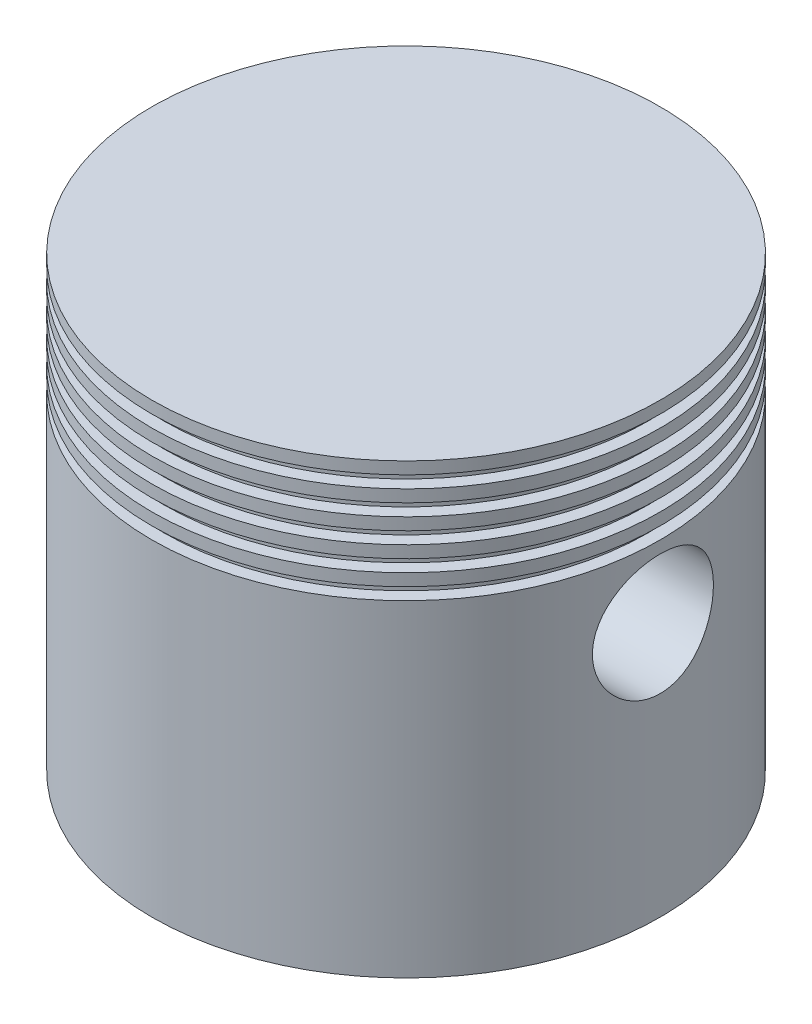
ISO-10303-21;
HEADER;
FILE_DESCRIPTION(('STEP AP214'),'2;1');
FILE_NAME('part.step','',(''),(''),'','','');
FILE_SCHEMA(('AUTOMOTIVE_DESIGN { 1 0 10303 214 1 1 1 1 }'));
ENDSEC;
DATA;
#1=APPLICATION_CONTEXT('core data for automotive mechanical design processes');
#2=APPLICATION_PROTOCOL_DEFINITION('international standard','automotive_design',2000,#1);
#3=PRODUCT_CONTEXT('',#1,'mechanical');
#4=PRODUCT('Part','Part','',(#3));
#5=PRODUCT_RELATED_PRODUCT_CATEGORY('part','',(#4));
#6=PRODUCT_DEFINITION_FORMATION('','',#4);
#7=PRODUCT_DEFINITION_CONTEXT('part definition',#1,'design');
#8=PRODUCT_DEFINITION('design','',#6,#7);
#9=PRODUCT_DEFINITION_SHAPE('','',#8);
#10=(LENGTH_UNIT() NAMED_UNIT(*) SI_UNIT(.MILLI.,.METRE.));
#11=(NAMED_UNIT(*) PLANE_ANGLE_UNIT() SI_UNIT($,.RADIAN.));
#12=(NAMED_UNIT(*) SI_UNIT($,.STERADIAN.) SOLID_ANGLE_UNIT());
#13=UNCERTAINTY_MEASURE_WITH_UNIT(LENGTH_MEASURE(1.E-05),#10,'distance_accuracy_value','');
#14=(GEOMETRIC_REPRESENTATION_CONTEXT(3) GLOBAL_UNCERTAINTY_ASSIGNED_CONTEXT((#13)) GLOBAL_UNIT_ASSIGNED_CONTEXT((#10,
#11,#12)) REPRESENTATION_CONTEXT('',''));
#15=CARTESIAN_POINT('',(0.,0.,0.));
#16=DIRECTION('',(0.,0.,1.));
#17=DIRECTION('',(1.,0.,0.));
#18=AXIS2_PLACEMENT_3D('',#15,#16,#17);
#19=CARTESIAN_POINT('',(0.,-18.5,0.));
#20=DIRECTION('',(0.,1.,0.));
#21=DIRECTION('',(0.,0.,1.));
#22=AXIS2_PLACEMENT_3D('',#19,#20,#21);
#23=CYLINDRICAL_SURFACE('',#22,10.5);
#24=CARTESIAN_POINT('',(0.,-4.,0.));
#25=DIRECTION('',(0.,1.,0.));
#26=DIRECTION('',(0.,0.,1.));
#27=AXIS2_PLACEMENT_3D('',#24,#25,#26);
#28=CIRCLE('',#27,10.5);
#29=CARTESIAN_POINT('',(0.,-4.,10.5));
#30=VERTEX_POINT('',#29);
#31=EDGE_CURVE('E219',#30,#30,#28,.T.);
#32=ORIENTED_EDGE('',*,*,#31,.F.);
#33=EDGE_LOOP('',(#32));
#34=FACE_BOUND('',#33,.T.);
#35=CARTESIAN_POINT('',(0.,-4.5,0.));
#36=DIRECTION('',(0.,1.,0.));
#37=DIRECTION('',(0.,0.,1.));
#38=AXIS2_PLACEMENT_3D('',#35,#36,#37);
#39=CIRCLE('',#38,10.5);
#40=CARTESIAN_POINT('',(0.,-4.5,10.5));
#41=VERTEX_POINT('',#40);
#42=EDGE_CURVE('E216',#41,#41,#39,.T.);
#43=ORIENTED_EDGE('',*,*,#42,.T.);
#44=EDGE_LOOP('',(#43));
#45=FACE_BOUND('',#44,.T.);
#46=ADVANCED_FACE('F33',(#34,#45),#23,.T.);
#47=CARTESIAN_POINT('',(0.,-3.,0.));
#48=DIRECTION('',(0.,1.,0.));
#49=DIRECTION('',(0.,0.,1.));
#50=AXIS2_PLACEMENT_3D('',#47,#48,#49);
#51=CIRCLE('',#50,10.5);
#52=CARTESIAN_POINT('',(0.,-3.,10.5));
#53=VERTEX_POINT('',#52);
#54=EDGE_CURVE('E231',#53,#53,#51,.T.);
#55=ORIENTED_EDGE('',*,*,#54,.F.);
#56=EDGE_LOOP('',(#55));
#57=FACE_BOUND('',#56,.T.);
#58=CARTESIAN_POINT('',(0.,-3.5,0.));
#59=DIRECTION('',(0.,1.,0.));
#60=DIRECTION('',(0.,0.,1.));
#61=AXIS2_PLACEMENT_3D('',#58,#59,#60);
#62=CIRCLE('',#61,10.5);
#63=CARTESIAN_POINT('',(0.,-3.5,10.5));
#64=VERTEX_POINT('',#63);
#65=EDGE_CURVE('E228',#64,#64,#62,.T.);
#66=ORIENTED_EDGE('',*,*,#65,.T.);
#67=EDGE_LOOP('',(#66));
#68=FACE_BOUND('',#67,.T.);
#69=ADVANCED_FACE('F184',(#57,#68),#23,.T.);
#70=CARTESIAN_POINT('',(0.,-2.,0.));
#71=DIRECTION('',(0.,1.,0.));
#72=DIRECTION('',(0.,0.,1.));
#73=AXIS2_PLACEMENT_3D('',#70,#71,#72);
#74=CIRCLE('',#73,10.5);
#75=CARTESIAN_POINT('',(0.,-2.,10.5));
#76=VERTEX_POINT('',#75);
#77=EDGE_CURVE('E243',#76,#76,#74,.T.);
#78=ORIENTED_EDGE('',*,*,#77,.F.);
#79=EDGE_LOOP('',(#78));
#80=FACE_BOUND('',#79,.T.);
#81=CARTESIAN_POINT('',(0.,-2.5,0.));
#82=DIRECTION('',(0.,1.,0.));
#83=DIRECTION('',(0.,0.,1.));
#84=AXIS2_PLACEMENT_3D('',#81,#82,#83);
#85=CIRCLE('',#84,10.5);
#86=CARTESIAN_POINT('',(0.,-2.5,10.5));
#87=VERTEX_POINT('',#86);
#88=EDGE_CURVE('E240',#87,#87,#85,.T.);
#89=ORIENTED_EDGE('',*,*,#88,.T.);
#90=EDGE_LOOP('',(#89));
#91=FACE_BOUND('',#90,.T.);
#92=ADVANCED_FACE('F189',(#80,#91),#23,.T.);
#93=CARTESIAN_POINT('',(0.,-1.,0.));
#94=DIRECTION('',(0.,1.,0.));
#95=DIRECTION('',(0.,0.,1.));
#96=AXIS2_PLACEMENT_3D('',#93,#94,#95);
#97=CIRCLE('',#96,10.5);
#98=CARTESIAN_POINT('',(0.,-1.,10.5));
#99=VERTEX_POINT('',#98);
#100=EDGE_CURVE('E255',#99,#99,#97,.T.);
#101=ORIENTED_EDGE('',*,*,#100,.F.);
#102=EDGE_LOOP('',(#101));
#103=FACE_BOUND('',#102,.T.);
#104=CARTESIAN_POINT('',(0.,-1.5,0.));
#105=DIRECTION('',(0.,1.,0.));
#106=DIRECTION('',(0.,0.,1.));
#107=AXIS2_PLACEMENT_3D('',#104,#105,#106);
#108=CIRCLE('',#107,10.5);
#109=CARTESIAN_POINT('',(0.,-1.5,10.5));
#110=VERTEX_POINT('',#109);
#111=EDGE_CURVE('E252',#110,#110,#108,.T.);
#112=ORIENTED_EDGE('',*,*,#111,.T.);
#113=EDGE_LOOP('',(#112));
#114=FACE_BOUND('',#113,.T.);
#115=ADVANCED_FACE('F123',(#103,#114),#23,.T.);
#116=CARTESIAN_POINT('',(0.,-0.5,-10.5));
#117=DIRECTION('',(0.,-1.,0.));
#118=DIRECTION('',(0.,0.,-1.));
#119=AXIS2_PLACEMENT_3D('',#116,#117,#118);
#120=PLANE('',#119);
#121=CARTESIAN_POINT('',(0.,-0.5,0.));
#122=DIRECTION('',(0.,1.,0.));
#123=DIRECTION('',(0.,0.,1.));
#124=AXIS2_PLACEMENT_3D('',#121,#122,#123);
#125=CIRCLE('',#124,10.);
#126=CARTESIAN_POINT('',(0.,-0.5,9.99999999999999));
#127=VERTEX_POINT('',#126);
#128=EDGE_CURVE('E128',#127,#127,#125,.T.);
#129=ORIENTED_EDGE('',*,*,#128,.T.);
#130=EDGE_LOOP('',(#129));
#131=FACE_BOUND('',#130,.T.);
#132=CARTESIAN_POINT('',(0.,-0.5,0.));
#133=DIRECTION('',(0.,1.,0.));
#134=DIRECTION('',(0.,0.,1.));
#135=AXIS2_PLACEMENT_3D('',#132,#133,#134);
#136=CIRCLE('',#135,10.5);
#137=CARTESIAN_POINT('',(0.,-0.5,10.5));
#138=VERTEX_POINT('',#137);
#139=EDGE_CURVE('E126',#138,#138,#136,.T.);
#140=ORIENTED_EDGE('',*,*,#139,.F.);
#141=EDGE_LOOP('',(#140));
#142=FACE_BOUND('',#141,.T.);
#143=ADVANCED_FACE('F154',(#131,#142),#120,.T.);
#144=CARTESIAN_POINT('',(0.,0.,0.));
#145=DIRECTION('',(0.,1.,0.));
#146=DIRECTION('',(0.,0.,1.));
#147=AXIS2_PLACEMENT_3D('',#144,#145,#146);
#148=CYLINDRICAL_SURFACE('',#147,10.);
#149=CARTESIAN_POINT('',(0.,-1.,0.));
#150=DIRECTION('',(0.,1.,0.));
#151=DIRECTION('',(0.,0.,1.));
#152=AXIS2_PLACEMENT_3D('',#149,#150,#151);
#153=CIRCLE('',#152,10.);
#154=CARTESIAN_POINT('',(0.,-1.,9.99999999999999));
#155=VERTEX_POINT('',#154);
#156=EDGE_CURVE('E133',#155,#155,#153,.T.);
#157=ORIENTED_EDGE('',*,*,#156,.T.);
#158=EDGE_LOOP('',(#157));
#159=FACE_BOUND('',#158,.T.);
#160=ORIENTED_EDGE('',*,*,#128,.F.);
#161=EDGE_LOOP('',(#160));
#162=FACE_BOUND('',#161,.T.);
#163=ADVANCED_FACE('F180',(#159,#162),#148,.T.);
#164=CARTESIAN_POINT('',(0.,-1.,-10.));
#165=DIRECTION('',(0.,1.,0.));
#166=DIRECTION('',(0.,0.,1.));
#167=AXIS2_PLACEMENT_3D('',#164,#165,#166);
#168=PLANE('',#167);
#169=ORIENTED_EDGE('',*,*,#100,.T.);
#170=EDGE_LOOP('',(#169));
#171=FACE_BOUND('',#170,.T.);
#172=ORIENTED_EDGE('',*,*,#156,.F.);
#173=EDGE_LOOP('',(#172));
#174=FACE_BOUND('',#173,.T.);
#175=ADVANCED_FACE('F176',(#171,#174),#168,.T.);
#176=CARTESIAN_POINT('',(0.,0.,0.));
#177=DIRECTION('',(0.,1.,0.));
#178=DIRECTION('',(0.,0.,1.));
#179=AXIS2_PLACEMENT_3D('',#176,#177,#178);
#180=PLANE('',#179);
#181=CARTESIAN_POINT('',(0.,0.,0.));
#182=DIRECTION('',(0.,1.,0.));
#183=DIRECTION('',(0.,0.,1.));
#184=AXIS2_PLACEMENT_3D('',#181,#182,#183);
#185=CIRCLE('',#184,10.5);
#186=CARTESIAN_POINT('',(0.,0.,10.5));
#187=VERTEX_POINT('',#186);
#188=EDGE_CURVE('E43',#187,#187,#185,.T.);
#189=ORIENTED_EDGE('',*,*,#188,.T.);
#190=EDGE_LOOP('',(#189));
#191=FACE_BOUND('',#190,.T.);
#192=ADVANCED_FACE('F118',(#191),#180,.T.);
#193=ORIENTED_EDGE('',*,*,#188,.F.);
#194=EDGE_LOOP('',(#193));
#195=FACE_BOUND('',#194,.T.);
#196=ORIENTED_EDGE('',*,*,#139,.T.);
#197=EDGE_LOOP('',(#196));
#198=FACE_BOUND('',#197,.T.);
#199=ADVANCED_FACE('F35',(#195,#198),#23,.T.);
#200=CARTESIAN_POINT('',(0.,-1.5,-10.5));
#201=DIRECTION('',(0.,-1.,0.));
#202=DIRECTION('',(0.,0.,-1.));
#203=AXIS2_PLACEMENT_3D('',#200,#201,#202);
#204=PLANE('',#203);
#205=CARTESIAN_POINT('',(0.,-1.5,0.));
#206=DIRECTION('',(0.,1.,0.));
#207=DIRECTION('',(0.,0.,1.));
#208=AXIS2_PLACEMENT_3D('',#205,#206,#207);
#209=CIRCLE('',#208,10.);
#210=CARTESIAN_POINT('',(0.,-1.5,9.99999999999999));
#211=VERTEX_POINT('',#210);
#212=EDGE_CURVE('E249',#211,#211,#209,.T.);
#213=ORIENTED_EDGE('',*,*,#212,.T.);
#214=EDGE_LOOP('',(#213));
#215=FACE_BOUND('',#214,.T.);
#216=ORIENTED_EDGE('',*,*,#111,.F.);
#217=EDGE_LOOP('',(#216));
#218=FACE_BOUND('',#217,.T.);
#219=ADVANCED_FACE('F122',(#215,#218),#204,.T.);
#220=CARTESIAN_POINT('',(0.,-1.,0.));
#221=DIRECTION('',(0.,1.,0.));
#222=DIRECTION('',(0.,0.,1.));
#223=AXIS2_PLACEMENT_3D('',#220,#221,#222);
#224=CYLINDRICAL_SURFACE('',#223,10.);
#225=CARTESIAN_POINT('',(0.,-2.,0.));
#226=DIRECTION('',(0.,1.,0.));
#227=DIRECTION('',(0.,0.,1.));
#228=AXIS2_PLACEMENT_3D('',#225,#226,#227);
#229=CIRCLE('',#228,10.);
#230=CARTESIAN_POINT('',(0.,-2.,9.99999999999999));
#231=VERTEX_POINT('',#230);
#232=EDGE_CURVE('E246',#231,#231,#229,.T.);
#233=ORIENTED_EDGE('',*,*,#232,.T.);
#234=EDGE_LOOP('',(#233));
#235=FACE_BOUND('',#234,.T.);
#236=ORIENTED_EDGE('',*,*,#212,.F.);
#237=EDGE_LOOP('',(#236));
#238=FACE_BOUND('',#237,.T.);
#239=ADVANCED_FACE('F279',(#235,#238),#224,.T.);
#240=CARTESIAN_POINT('',(0.,-2.,-10.));
#241=DIRECTION('',(0.,1.,0.));
#242=DIRECTION('',(0.,0.,1.));
#243=AXIS2_PLACEMENT_3D('',#240,#241,#242);
#244=PLANE('',#243);
#245=ORIENTED_EDGE('',*,*,#77,.T.);
#246=EDGE_LOOP('',(#245));
#247=FACE_BOUND('',#246,.T.);
#248=ORIENTED_EDGE('',*,*,#232,.F.);
#249=EDGE_LOOP('',(#248));
#250=FACE_BOUND('',#249,.T.);
#251=ADVANCED_FACE('F285',(#247,#250),#244,.T.);
#252=CARTESIAN_POINT('',(0.,-2.5,-10.5));
#253=DIRECTION('',(0.,-1.,0.));
#254=DIRECTION('',(0.,0.,-1.));
#255=AXIS2_PLACEMENT_3D('',#252,#253,#254);
#256=PLANE('',#255);
#257=CARTESIAN_POINT('',(0.,-2.5,0.));
#258=DIRECTION('',(0.,1.,0.));
#259=DIRECTION('',(0.,0.,1.));
#260=AXIS2_PLACEMENT_3D('',#257,#258,#259);
#261=CIRCLE('',#260,10.);
#262=CARTESIAN_POINT('',(0.,-2.5,9.99999999999999));
#263=VERTEX_POINT('',#262);
#264=EDGE_CURVE('E237',#263,#263,#261,.T.);
#265=ORIENTED_EDGE('',*,*,#264,.T.);
#266=EDGE_LOOP('',(#265));
#267=FACE_BOUND('',#266,.T.);
#268=ORIENTED_EDGE('',*,*,#88,.F.);
#269=EDGE_LOOP('',(#268));
#270=FACE_BOUND('',#269,.T.);
#271=ADVANCED_FACE('F291',(#267,#270),#256,.T.);
#272=CARTESIAN_POINT('',(0.,-2.,0.));
#273=DIRECTION('',(0.,1.,0.));
#274=DIRECTION('',(0.,0.,1.));
#275=AXIS2_PLACEMENT_3D('',#272,#273,#274);
#276=CYLINDRICAL_SURFACE('',#275,10.);
#277=CARTESIAN_POINT('',(0.,-3.,0.));
#278=DIRECTION('',(0.,1.,0.));
#279=DIRECTION('',(0.,0.,1.));
#280=AXIS2_PLACEMENT_3D('',#277,#278,#279);
#281=CIRCLE('',#280,10.);
#282=CARTESIAN_POINT('',(0.,-3.,9.99999999999999));
#283=VERTEX_POINT('',#282);
#284=EDGE_CURVE('E234',#283,#283,#281,.T.);
#285=ORIENTED_EDGE('',*,*,#284,.T.);
#286=EDGE_LOOP('',(#285));
#287=FACE_BOUND('',#286,.T.);
#288=ORIENTED_EDGE('',*,*,#264,.F.);
#289=EDGE_LOOP('',(#288));
#290=FACE_BOUND('',#289,.T.);
#291=ADVANCED_FACE('F295',(#287,#290),#276,.T.);
#292=CARTESIAN_POINT('',(0.,-3.,-10.));
#293=DIRECTION('',(0.,1.,0.));
#294=DIRECTION('',(0.,0.,1.));
#295=AXIS2_PLACEMENT_3D('',#292,#293,#294);
#296=PLANE('',#295);
#297=ORIENTED_EDGE('',*,*,#54,.T.);
#298=EDGE_LOOP('',(#297));
#299=FACE_BOUND('',#298,.T.);
#300=ORIENTED_EDGE('',*,*,#284,.F.);
#301=EDGE_LOOP('',(#300));
#302=FACE_BOUND('',#301,.T.);
#303=ADVANCED_FACE('F299',(#299,#302),#296,.T.);
#304=CARTESIAN_POINT('',(0.,-3.5,-10.5));
#305=DIRECTION('',(0.,-1.,0.));
#306=DIRECTION('',(0.,0.,-1.));
#307=AXIS2_PLACEMENT_3D('',#304,#305,#306);
#308=PLANE('',#307);
#309=CARTESIAN_POINT('',(0.,-3.5,0.));
#310=DIRECTION('',(0.,1.,0.));
#311=DIRECTION('',(0.,0.,1.));
#312=AXIS2_PLACEMENT_3D('',#309,#310,#311);
#313=CIRCLE('',#312,10.);
#314=CARTESIAN_POINT('',(0.,-3.5,9.99999999999999));
#315=VERTEX_POINT('',#314);
#316=EDGE_CURVE('E225',#315,#315,#313,.T.);
#317=ORIENTED_EDGE('',*,*,#316,.T.);
#318=EDGE_LOOP('',(#317));
#319=FACE_BOUND('',#318,.T.);
#320=ORIENTED_EDGE('',*,*,#65,.F.);
#321=EDGE_LOOP('',(#320));
#322=FACE_BOUND('',#321,.T.);
#323=ADVANCED_FACE('F303',(#319,#322),#308,.T.);
#324=CARTESIAN_POINT('',(0.,-3.,0.));
#325=DIRECTION('',(0.,1.,0.));
#326=DIRECTION('',(0.,0.,1.));
#327=AXIS2_PLACEMENT_3D('',#324,#325,#326);
#328=CYLINDRICAL_SURFACE('',#327,10.);
#329=CARTESIAN_POINT('',(0.,-4.,0.));
#330=DIRECTION('',(0.,1.,0.));
#331=DIRECTION('',(0.,0.,1.));
#332=AXIS2_PLACEMENT_3D('',#329,#330,#331);
#333=CIRCLE('',#332,10.);
#334=CARTESIAN_POINT('',(0.,-4.,9.99999999999999));
#335=VERTEX_POINT('',#334);
#336=EDGE_CURVE('E222',#335,#335,#333,.T.);
#337=ORIENTED_EDGE('',*,*,#336,.T.);
#338=EDGE_LOOP('',(#337));
#339=FACE_BOUND('',#338,.T.);
#340=ORIENTED_EDGE('',*,*,#316,.F.);
#341=EDGE_LOOP('',(#340));
#342=FACE_BOUND('',#341,.T.);
#343=ADVANCED_FACE('F307',(#339,#342),#328,.T.);
#344=CARTESIAN_POINT('',(0.,-4.,-10.));
#345=DIRECTION('',(0.,1.,0.));
#346=DIRECTION('',(0.,0.,1.));
#347=AXIS2_PLACEMENT_3D('',#344,#345,#346);
#348=PLANE('',#347);
#349=ORIENTED_EDGE('',*,*,#31,.T.);
#350=EDGE_LOOP('',(#349));
#351=FACE_BOUND('',#350,.T.);
#352=ORIENTED_EDGE('',*,*,#336,.F.);
#353=EDGE_LOOP('',(#352));
#354=FACE_BOUND('',#353,.T.);
#355=ADVANCED_FACE('F311',(#351,#354),#348,.T.);
#356=CARTESIAN_POINT('',(0.,-4.5,-10.5));
#357=DIRECTION('',(0.,-1.,0.));
#358=DIRECTION('',(0.,0.,-1.));
#359=AXIS2_PLACEMENT_3D('',#356,#357,#358);
#360=PLANE('',#359);
#361=CARTESIAN_POINT('',(0.,-4.5,0.));
#362=DIRECTION('',(0.,1.,0.));
#363=DIRECTION('',(0.,0.,1.));
#364=AXIS2_PLACEMENT_3D('',#361,#362,#363);
#365=CIRCLE('',#364,10.);
#366=CARTESIAN_POINT('',(0.,-4.5,9.99999999999999));
#367=VERTEX_POINT('',#366);
#368=EDGE_CURVE('E211',#367,#367,#365,.T.);
#369=ORIENTED_EDGE('',*,*,#368,.T.);
#370=EDGE_LOOP('',(#369));
#371=FACE_BOUND('',#370,.T.);
#372=ORIENTED_EDGE('',*,*,#42,.F.);
#373=EDGE_LOOP('',(#372));
#374=FACE_BOUND('',#373,.T.);
#375=ADVANCED_FACE('F315',(#371,#374),#360,.T.);
#376=CARTESIAN_POINT('',(0.,-4.,0.));
#377=DIRECTION('',(0.,1.,0.));
#378=DIRECTION('',(0.,0.,1.));
#379=AXIS2_PLACEMENT_3D('',#376,#377,#378);
#380=CYLINDRICAL_SURFACE('',#379,10.);
#381=CARTESIAN_POINT('',(0.,-5.,0.));
#382=DIRECTION('',(0.,1.,0.));
#383=DIRECTION('',(0.,0.,1.));
#384=AXIS2_PLACEMENT_3D('',#381,#382,#383);
#385=CIRCLE('',#384,10.);
#386=CARTESIAN_POINT('',(0.,-5.,9.99999999999999));
#387=VERTEX_POINT('',#386);
#388=EDGE_CURVE('E208',#387,#387,#385,.T.);
#389=ORIENTED_EDGE('',*,*,#388,.T.);
#390=EDGE_LOOP('',(#389));
#391=FACE_BOUND('',#390,.T.);
#392=ORIENTED_EDGE('',*,*,#368,.F.);
#393=EDGE_LOOP('',(#392));
#394=FACE_BOUND('',#393,.T.);
#395=ADVANCED_FACE('F319',(#391,#394),#380,.T.);
#396=CARTESIAN_POINT('',(0.,-5.,-10.));
#397=DIRECTION('',(0.,1.,0.));
#398=DIRECTION('',(0.,0.,1.));
#399=AXIS2_PLACEMENT_3D('',#396,#397,#398);
#400=PLANE('',#399);
#401=CARTESIAN_POINT('',(0.,-5.,0.));
#402=DIRECTION('',(0.,1.,0.));
#403=DIRECTION('',(0.,0.,1.));
#404=AXIS2_PLACEMENT_3D('',#401,#402,#403);
#405=CIRCLE('',#404,10.5);
#406=CARTESIAN_POINT('',(0.,-5.,10.5));
#407=VERTEX_POINT('',#406);
#408=EDGE_CURVE('E206',#407,#407,#405,.T.);
#409=ORIENTED_EDGE('',*,*,#408,.T.);
#410=EDGE_LOOP('',(#409));
#411=FACE_BOUND('',#410,.T.);
#412=ORIENTED_EDGE('',*,*,#388,.F.);
#413=EDGE_LOOP('',(#412));
#414=FACE_BOUND('',#413,.T.);
#415=ADVANCED_FACE('F159',(#411,#414),#400,.T.);
#416=CARTESIAN_POINT('',(0.,-2.,0.));
#417=DIRECTION('',(0.,-1.,0.));
#418=DIRECTION('',(0.,0.,-1.));
#419=AXIS2_PLACEMENT_3D('',#416,#417,#418);
#420=PLANE('',#419);
#421=CARTESIAN_POINT('',(0.,-2.,0.));
#422=DIRECTION('',(0.,-1.,0.));
#423=DIRECTION('',(0.,0.,-1.));
#424=AXIS2_PLACEMENT_3D('',#421,#422,#423);
#425=CIRCLE('',#424,9.);
#426=CARTESIAN_POINT('',(6.25,-2.,6.47591692349431));
#427=VERTEX_POINT('',#426);
#428=CARTESIAN_POINT('',(-6.25,-2.,6.47591692349431));
#429=VERTEX_POINT('',#428);
#430=EDGE_CURVE('E100',#427,#429,#425,.T.);
#431=ORIENTED_EDGE('',*,*,#430,.T.);
#432=DIRECTION('',(0.,0.,-1.));
#433=VECTOR('',#432,1.);
#434=CARTESIAN_POINT('',(-6.25,-2.,6.47591692349431));
#435=LINE('',#434,#433);
#436=CARTESIAN_POINT('',(-6.25,-2.,-6.47591692349431));
#437=VERTEX_POINT('',#436);
#438=EDGE_CURVE('E83',#429,#437,#435,.T.);
#439=ORIENTED_EDGE('',*,*,#438,.T.);
#440=CARTESIAN_POINT('',(0.,-2.,0.));
#441=DIRECTION('',(0.,-1.,0.));
#442=DIRECTION('',(0.,0.,-1.));
#443=AXIS2_PLACEMENT_3D('',#440,#441,#442);
#444=CIRCLE('',#443,9.);
#445=CARTESIAN_POINT('',(6.25,-2.,-6.47591692349431));
#446=VERTEX_POINT('',#445);
#447=EDGE_CURVE('E93',#437,#446,#444,.T.);
#448=ORIENTED_EDGE('',*,*,#447,.T.);
#449=DIRECTION('',(0.,0.,1.));
#450=VECTOR('',#449,1.);
#451=CARTESIAN_POINT('',(6.25,-2.,-6.47591692349431));
#452=LINE('',#451,#450);
#453=EDGE_CURVE('E97',#446,#427,#452,.T.);
#454=ORIENTED_EDGE('',*,*,#453,.T.);
#455=EDGE_LOOP('',(#431,#439,#448,#454));
#456=FACE_BOUND('',#455,.T.);
#457=ADVANCED_FACE('F99',(#456),#420,.T.);
#458=CARTESIAN_POINT('',(0.,-2.,0.));
#459=DIRECTION('',(0.,-1.,0.));
#460=DIRECTION('',(0.,0.,-1.));
#461=AXIS2_PLACEMENT_3D('',#458,#459,#460);
#462=CYLINDRICAL_SURFACE('',#461,9.);
#463=CARTESIAN_POINT('',(0.,-18.5,0.));
#464=DIRECTION('',(0.,-1.,0.));
#465=DIRECTION('',(0.,0.,-1.));
#466=AXIS2_PLACEMENT_3D('',#463,#464,#465);
#467=CIRCLE('',#466,9.);
#468=CARTESIAN_POINT('',(-6.25,-18.5,-6.47591692349431));
#469=VERTEX_POINT('',#468);
#470=CARTESIAN_POINT('',(6.25,-18.5,-6.47591692349431));
#471=VERTEX_POINT('',#470);
#472=EDGE_CURVE('E110',#469,#471,#467,.T.);
#473=ORIENTED_EDGE('',*,*,#472,.T.);
#474=DIRECTION('',(0.,-1.,0.));
#475=VECTOR('',#474,1.);
#476=CARTESIAN_POINT('',(6.25,-2.,-6.47591692349431));
#477=LINE('',#476,#475);
#478=EDGE_CURVE('E90',#446,#471,#477,.T.);
#479=ORIENTED_EDGE('',*,*,#478,.F.);
#480=ORIENTED_EDGE('',*,*,#447,.F.);
#481=DIRECTION('',(0.,-1.,0.));
#482=VECTOR('',#481,1.);
#483=CARTESIAN_POINT('',(-6.25,-2.,-6.47591692349431));
#484=LINE('',#483,#482);
#485=EDGE_CURVE('E79',#437,#469,#484,.T.);
#486=ORIENTED_EDGE('',*,*,#485,.T.);
#487=EDGE_LOOP('',(#473,#479,#480,#486));
#488=FACE_BOUND('',#487,.T.);
#489=ADVANCED_FACE('F94',(#488),#462,.F.);
#490=CARTESIAN_POINT('',(6.25,-2.,-6.47591692349431));
#491=DIRECTION('',(1.,0.,0.));
#492=DIRECTION('',(0.,0.,-1.));
#493=AXIS2_PLACEMENT_3D('',#490,#491,#492);
#494=PLANE('',#493);
#495=CARTESIAN_POINT('',(6.25,-8.,0.));
#496=DIRECTION('',(1.,0.,0.));
#497=DIRECTION('',(0.,0.,-1.));
#498=AXIS2_PLACEMENT_3D('',#495,#496,#497);
#499=CIRCLE('',#498,2.5);
#500=CARTESIAN_POINT('',(6.25,-8.,-2.5));
#501=VERTEX_POINT('',#500);
#502=EDGE_CURVE('E131',#501,#501,#499,.T.);
#503=ORIENTED_EDGE('',*,*,#502,.T.);
#504=EDGE_LOOP('',(#503));
#505=FACE_BOUND('',#504,.T.);
#506=DIRECTION('',(0.,0.,1.));
#507=VECTOR('',#506,1.);
#508=CARTESIAN_POINT('',(6.25,-18.5,-6.47591692349431));
#509=LINE('',#508,#507);
#510=CARTESIAN_POINT('',(6.25,-18.5,6.47591692349431));
#511=VERTEX_POINT('',#510);
#512=EDGE_CURVE('E102',#471,#511,#509,.T.);
#513=ORIENTED_EDGE('',*,*,#512,.T.);
#514=DIRECTION('',(0.,-1.,0.));
#515=VECTOR('',#514,1.);
#516=CARTESIAN_POINT('',(6.25,-2.,6.47591692349431));
#517=LINE('',#516,#515);
#518=EDGE_CURVE('E59',#427,#511,#517,.T.);
#519=ORIENTED_EDGE('',*,*,#518,.F.);
#520=ORIENTED_EDGE('',*,*,#453,.F.);
#521=ORIENTED_EDGE('',*,*,#478,.T.);
#522=EDGE_LOOP('',(#513,#519,#520,#521));
#523=FACE_BOUND('',#522,.T.);
#524=ADVANCED_FACE('F160',(#505,#523),#494,.F.);
#525=CARTESIAN_POINT('',(0.,-2.,0.));
#526=DIRECTION('',(0.,-1.,0.));
#527=DIRECTION('',(0.,0.,-1.));
#528=AXIS2_PLACEMENT_3D('',#525,#526,#527);
#529=CYLINDRICAL_SURFACE('',#528,9.);
#530=CARTESIAN_POINT('',(0.,-18.5,0.));
#531=DIRECTION('',(0.,-1.,0.));
#532=DIRECTION('',(0.,0.,-1.));
#533=AXIS2_PLACEMENT_3D('',#530,#531,#532);
#534=CIRCLE('',#533,9.);
#535=CARTESIAN_POINT('',(-6.25,-18.5,6.47591692349431));
#536=VERTEX_POINT('',#535);
#537=EDGE_CURVE('E51',#511,#536,#534,.T.);
#538=ORIENTED_EDGE('',*,*,#537,.T.);
#539=DIRECTION('',(0.,-1.,0.));
#540=VECTOR('',#539,1.);
#541=CARTESIAN_POINT('',(-6.25,-2.,6.47591692349431));
#542=LINE('',#541,#540);
#543=EDGE_CURVE('E74',#429,#536,#542,.T.);
#544=ORIENTED_EDGE('',*,*,#543,.F.);
#545=ORIENTED_EDGE('',*,*,#430,.F.);
#546=ORIENTED_EDGE('',*,*,#518,.T.);
#547=EDGE_LOOP('',(#538,#544,#545,#546));
#548=FACE_BOUND('',#547,.T.);
#549=ADVANCED_FACE('F163',(#548),#529,.F.);
#550=CARTESIAN_POINT('',(-6.25,-2.,6.47591692349431));
#551=DIRECTION('',(-1.,0.,0.));
#552=DIRECTION('',(0.,0.,1.));
#553=AXIS2_PLACEMENT_3D('',#550,#551,#552);
#554=PLANE('',#553);
#555=CARTESIAN_POINT('',(-6.25,-8.,0.));
#556=DIRECTION('',(-1.,0.,0.));
#557=DIRECTION('',(0.,0.,1.));
#558=AXIS2_PLACEMENT_3D('',#555,#556,#557);
#559=CIRCLE('',#558,2.5);
#560=CARTESIAN_POINT('',(-6.25,-8.,2.5));
#561=VERTEX_POINT('',#560);
#562=EDGE_CURVE('E38',#561,#561,#559,.T.);
#563=ORIENTED_EDGE('',*,*,#562,.T.);
#564=EDGE_LOOP('',(#563));
#565=FACE_BOUND('',#564,.T.);
#566=DIRECTION('',(0.,0.,-1.));
#567=VECTOR('',#566,1.);
#568=CARTESIAN_POINT('',(-6.25,-18.5,6.47591692349431));
#569=LINE('',#568,#567);
#570=EDGE_CURVE('E86',#536,#469,#569,.T.);
#571=ORIENTED_EDGE('',*,*,#570,.T.);
#572=ORIENTED_EDGE('',*,*,#485,.F.);
#573=ORIENTED_EDGE('',*,*,#438,.F.);
#574=ORIENTED_EDGE('',*,*,#543,.T.);
#575=EDGE_LOOP('',(#571,#572,#573,#574));
#576=FACE_BOUND('',#575,.T.);
#577=ADVANCED_FACE('F81',(#565,#576),#554,.F.);
#578=CARTESIAN_POINT('',(-10.5,-8.,0.));
#579=DIRECTION('',(1.,0.,0.));
#580=DIRECTION('',(0.,0.,-1.));
#581=AXIS2_PLACEMENT_3D('',#578,#579,#580);
#582=CYLINDRICAL_SURFACE('',#581,2.5);
#583=CARTESIAN_POINT('',(-10.5,-5.5,0.));
#584=CARTESIAN_POINT('',(-10.4999975434588,-5.50000424180749,-0.138336137279082));
#585=CARTESIAN_POINT('',(-10.4972387033951,-5.51152082446473,-0.276721109569138));
#586=CARTESIAN_POINT('',(-10.4865001085106,-5.55722228671618,-0.549538850757648));
#587=CARTESIAN_POINT('',(-10.4785170902483,-5.59142133578235,-0.68396909432786));
#588=CARTESIAN_POINT('',(-10.4582160616993,-5.68133897261751,-0.944897052807475));
#589=CARTESIAN_POINT('',(-10.4459029937755,-5.73703303279754,-1.07140361874548));
#590=CARTESIAN_POINT('',(-10.4182601205493,-5.86827670962488,-1.31327613755792));
#591=CARTESIAN_POINT('',(-10.4029302831811,-5.94382653732517,-1.42864197199632));
#592=CARTESIAN_POINT('',(-10.3706017150262,-6.11413933489629,-1.64712984534485));
#593=CARTESIAN_POINT('',(-10.3535791863802,-6.2092050225848,-1.75001240826077));
#594=CARTESIAN_POINT('',(-10.3199455954121,-6.41520215638095,-1.93853379683689));
#595=CARTESIAN_POINT('',(-10.3033345756337,-6.52613523497011,-2.02417084604484));
#596=CARTESIAN_POINT('',(-10.2721670426225,-6.76254247521067,-2.17686887987817));
#597=CARTESIAN_POINT('',(-10.2576408584752,-6.88819071580068,-2.24366710465667));
#598=CARTESIAN_POINT('',(-10.2326327070929,-7.14933361090562,-2.35510329990628));
#599=CARTESIAN_POINT('',(-10.2221501588518,-7.28482684752441,-2.39974445425968));
#600=CARTESIAN_POINT('',(-10.2066599201534,-7.55919388856048,-2.46479239184226));
#601=CARTESIAN_POINT('',(-10.2015556620545,-7.69796063624394,-2.48562721809095));
#602=CARTESIAN_POINT('',(-10.1971105041989,-7.97710649992391,-2.5038034744538));
#603=CARTESIAN_POINT('',(-10.1977687587762,-8.11748537631607,-2.50114835178745));
#604=CARTESIAN_POINT('',(-10.2046871951112,-8.39262965621027,-2.47276275553414));
#605=CARTESIAN_POINT('',(-10.2108247966834,-8.52745070658217,-2.44753718505243));
#606=CARTESIAN_POINT('',(-10.2278156410081,-8.79089026058869,-2.37553000240983));
#607=CARTESIAN_POINT('',(-10.2386691917041,-8.91950835857152,-2.32874698257163));
#608=CARTESIAN_POINT('',(-10.2639847745444,-9.16827068791426,-2.21450959138648));
#609=CARTESIAN_POINT('',(-10.2784793105356,-9.28832535893374,-2.14686769876002));
#610=CARTESIAN_POINT('',(-10.3094247325612,-9.51556352760123,-1.99296407487243));
#611=CARTESIAN_POINT('',(-10.3258759311678,-9.62274496326893,-1.9066993668615));
#612=CARTESIAN_POINT('',(-10.3594010879078,-9.82409310176283,-1.71536077381319));
#613=CARTESIAN_POINT('',(-10.3764801697085,-9.91785325943472,-1.60985948183825));
#614=CARTESIAN_POINT('',(-10.408952960856,-10.0864232572628,-1.3844300128221));
#615=CARTESIAN_POINT('',(-10.4243466276942,-10.1612326195152,-1.264501472065));
#616=CARTESIAN_POINT('',(-10.4517795741869,-10.2899071582899,-1.01307505062908));
#617=CARTESIAN_POINT('',(-10.4638090606989,-10.3437113650966,-0.881544829738132));
#618=CARTESIAN_POINT('',(-10.4830865467713,-10.4283359503764,-0.610957907853852));
#619=CARTESIAN_POINT('',(-10.4903353736449,-10.4591603057297,-0.471902513632526));
#620=CARTESIAN_POINT('',(-10.4991142042131,-10.4963410533715,-0.193692828601947));
#621=CARTESIAN_POINT('',(-10.5007737352137,-10.5032517310935,-0.0546165957888364));
#622=CARTESIAN_POINT('',(-10.4985535541471,-10.4939221307586,0.222704057862656));
#623=CARTESIAN_POINT('',(-10.4946742915552,-10.4776837312583,0.360948545283293));
#624=CARTESIAN_POINT('',(-10.4818949226634,-10.422975043256,0.630790741549755));
#625=CARTESIAN_POINT('',(-10.4730621053881,-10.3848025399095,0.762452297252527));
#626=CARTESIAN_POINT('',(-10.4513679020005,-10.2876455474634,1.01749963236655));
#627=CARTESIAN_POINT('',(-10.4385061322285,-10.2286590762717,1.14088462227697));
#628=CARTESIAN_POINT('',(-10.409866446553,-10.0904426738418,1.37811619208856));
#629=CARTESIAN_POINT('',(-10.3940441187298,-10.0108962740785,1.4917729035137));
#630=CARTESIAN_POINT('',(-10.3613160355687,-9.83422727743229,1.70432235091455));
#631=CARTESIAN_POINT('',(-10.3444101118625,-9.73710194485137,1.80321278453018));
#632=CARTESIAN_POINT('',(-10.3109612771398,-9.52546934736392,1.98567065399475));
#633=CARTESIAN_POINT('',(-10.2944346495537,-9.41062533361608,2.0688510846241));
#634=CARTESIAN_POINT('',(-10.2640365377705,-9.16827705871023,2.21475282460654));
#635=CARTESIAN_POINT('',(-10.2501649347375,-9.04077336457346,2.27747504973449));
#636=CARTESIAN_POINT('',(-10.2267935635251,-8.7774208574059,2.38022508390675));
#637=CARTESIAN_POINT('',(-10.2172681301925,-8.6416265491557,2.42038645459652));
#638=CARTESIAN_POINT('',(-10.2036331095431,-8.36495547583987,2.47724487394362));
#639=CARTESIAN_POINT('',(-10.1995224671764,-8.22407970637377,2.49394649367997));
#640=CARTESIAN_POINT('',(-10.1972574673118,-7.94516778642589,2.50318954108941));
#641=CARTESIAN_POINT('',(-10.1989511308176,-7.80715295541481,2.49634741508249));
#642=CARTESIAN_POINT('',(-10.2077555543581,-7.53430496285091,2.46009509206175));
#643=CARTESIAN_POINT('',(-10.2148662244421,-7.39947174850485,2.43068526979016));
#644=CARTESIAN_POINT('',(-10.2336228462105,-7.13741326473085,2.35045423221714));
#645=CARTESIAN_POINT('',(-10.2452464481714,-7.01015401363978,2.29973843208311));
#646=CARTESIAN_POINT('',(-10.27172440324,-6.76586466802633,2.17842046384604));
#647=CARTESIAN_POINT('',(-10.2865791619473,-6.6488358602953,2.10781579881189));
#648=CARTESIAN_POINT('',(-10.3182872131225,-6.42532648907886,1.94674761804941));
#649=CARTESIAN_POINT('',(-10.3351796370419,-6.31916302250194,1.85585170179885));
#650=CARTESIAN_POINT('',(-10.3688150077968,-6.12339488185176,1.65763740981362));
#651=CARTESIAN_POINT('',(-10.3855579186664,-6.03379409504394,1.55031518959779));
#652=CARTESIAN_POINT('',(-10.4173269419941,-5.8723054893828,1.32022210682979));
#653=CARTESIAN_POINT('',(-10.4323212879319,-5.8007241214387,1.19723147883353));
#654=CARTESIAN_POINT('',(-10.4585757917461,-5.67936650621807,0.940622423064202));
#655=CARTESIAN_POINT('',(-10.4698388073384,-5.62957356240887,0.807012226205199));
#656=CARTESIAN_POINT('',(-10.4855584350762,-5.56119151919507,0.561236558719236));
#657=CARTESIAN_POINT('',(-10.4909382999675,-5.5382919261676,0.450309308650696));
#658=CARTESIAN_POINT('',(-10.4981599779711,-5.50769490058183,0.22626550574761));
#659=CARTESIAN_POINT('',(-10.5000020092754,-5.49999653050418,0.113149088362173));
#660=CARTESIAN_POINT('',(-10.5,-5.5,0.));
#661=B_SPLINE_CURVE_WITH_KNOTS('',3,(#583,#584,#585,#586,#587,#588,#589,#590,#591,#592,#593,
#594,#595,#596,#597,#598,#599,#600,#601,#602,#603,#604,#605,#606,#607,#608,#609,#610,#611,#612,
#613,#614,#615,#616,#617,#618,#619,#620,#621,#622,#623,#624,#625,#626,#627,#628,#629,#630,#631,
#632,#633,#634,#635,#636,#637,#638,#639,#640,#641,#642,#643,#644,#645,#646,#647,#648,#649,#650,
#651,#652,#653,#654,#655,#656,#657,#658,#659,#660),.UNSPECIFIED.,.T.,.F.,(4,2,2,2,2,2,2,2,2,2,2,
2,2,2,2,2,2,2,2,2,2,2,2,2,2,2,2,2,2,2,2,2,2,2,2,2,2,2,4),(0.,0.414593955930679,
0.829447148107668,1.24382835136143,1.65821395937717,2.07959257414167,2.50101457274044,
2.92805259420199,3.3550292342317,3.77420157375972,4.1933123995274,4.60327579077322,
5.01326595596385,5.42705503347366,5.84091030182319,6.26543010829714,6.68996061930459,
7.11571437325671,7.54139442939284,7.9571392070003,8.37285024867884,8.78304648285509,
9.19328179013112,9.61025259265382,10.0272883415858,10.4535420182195,10.8797766117527,
11.3034605352545,11.7270618934519,12.1396574070664,12.5522460695774,12.9628169794916,
13.3734394571811,13.7938286071533,14.2143162976455,14.6415339491408,15.0684236467355,
15.4075528325544,15.7466611022857),.UNSPECIFIED.);
#662=CARTESIAN_POINT('',(-10.5,-5.5,0.));
#663=VERTEX_POINT('',#662);
#664=EDGE_CURVE('E108',#663,#663,#661,.T.);
#665=ORIENTED_EDGE('',*,*,#664,.T.);
#666=EDGE_LOOP('',(#665));
#667=FACE_BOUND('',#666,.T.);
#668=ORIENTED_EDGE('',*,*,#562,.F.);
#669=EDGE_LOOP('',(#668));
#670=FACE_BOUND('',#669,.T.);
#671=ADVANCED_FACE('F152',(#667,#670),#582,.F.);
#672=CARTESIAN_POINT('',(10.1980390271856,-8.,-2.5));
#673=CARTESIAN_POINT('',(10.1980417662799,-7.86172652663562,-2.49999571771621));
#674=CARTESIAN_POINT('',(10.2008819480951,-7.72340412660828,-2.48848921004997));
#675=CARTESIAN_POINT('',(10.2119100495576,-7.45071622647227,-2.44283138746475));
#676=CARTESIAN_POINT('',(10.220101377256,-7.31635330511972,-2.40866564106247));
#677=CARTESIAN_POINT('',(10.2408526576227,-7.05556807045905,-2.31884533433252));
#678=CARTESIAN_POINT('',(10.2534073056611,-6.92913633428162,-2.26321685793814));
#679=CARTESIAN_POINT('',(10.2814641264546,-6.6873904161032,-2.13212786900036));
#680=CARTESIAN_POINT('',(10.2969663519875,-6.57207643322669,-2.05666700133913));
#681=CARTESIAN_POINT('',(10.3295180748048,-6.35353514341651,-1.88644621865885));
#682=CARTESIAN_POINT('',(10.3465903884589,-6.25056256471987,-1.79136356790472));
#683=CARTESIAN_POINT('',(10.3801600371474,-6.06186598464005,-1.5852940689898));
#684=CARTESIAN_POINT('',(10.3966573220513,-5.97614348400938,-1.47430583848449));
#685=CARTESIAN_POINT('',(10.4274690302773,-5.82335182577337,-1.23784521107821));
#686=CARTESIAN_POINT('',(10.4417533871947,-5.75653085494883,-1.11220818954147));
#687=CARTESIAN_POINT('',(10.4662704926092,-5.64504957424471,-0.851089407039723));
#688=CARTESIAN_POINT('',(10.4765037817733,-5.60038630693333,-0.715608962664383));
#689=CARTESIAN_POINT('',(10.4916044652571,-5.53529836938973,-0.441302152334319));
#690=CARTESIAN_POINT('',(10.4965673832561,-5.51444167174176,-0.302583647149308));
#691=CARTESIAN_POINT('',(10.5009002595401,-5.49620492239017,-0.0235338053366261));
#692=CARTESIAN_POINT('',(10.5002709707842,-5.49882171011448,0.116797311620906));
#693=CARTESIAN_POINT('',(10.4935621966644,-5.52714255285135,0.392099723100522));
#694=CARTESIAN_POINT('',(10.4875927382963,-5.55238054861658,0.527122043139071));
#695=CARTESIAN_POINT('',(10.4710013525068,-5.62448081973773,0.790957522089009));
#696=CARTESIAN_POINT('',(10.4603791910467,-5.67134418289254,0.919770368291499));
#697=CARTESIAN_POINT('',(10.4355041622277,-5.78575574021175,1.16878421413462));
#698=CARTESIAN_POINT('',(10.4212216064534,-5.85347403438117,1.28890397251028));
#699=CARTESIAN_POINT('',(10.3905818447092,-6.00754506665896,1.51624078669456));
#700=CARTESIAN_POINT('',(10.374224308387,-6.09390077352069,1.6234557826605));
#701=CARTESIAN_POINT('',(10.3407488740336,-6.28530950179743,1.82471663379566));
#702=CARTESIAN_POINT('',(10.3236221697636,-6.39077013097475,1.91837375712402));
#703=CARTESIAN_POINT('',(10.2909102679344,-6.61607975312487,2.08675450345623));
#704=CARTESIAN_POINT('',(10.2753251293859,-6.73592929651244,2.1614774018346));
#705=CARTESIAN_POINT('',(10.2474324080862,-6.98732368488548,2.2900867389068));
#706=CARTESIAN_POINT('',(10.2351383452793,-7.11891389915706,2.34388762597934));
#707=CARTESIAN_POINT('',(10.2153979164771,-7.38963266599714,2.42848774223003));
#708=CARTESIAN_POINT('',(10.2079506213779,-7.52875976823537,2.45929138004507));
#709=CARTESIAN_POINT('',(10.19893984574,-7.80701884452661,2.49639439645703));
#710=CARTESIAN_POINT('',(10.197239217194,-7.94607029077637,2.50326507643121));
#711=CARTESIAN_POINT('',(10.199542325466,-8.22333223882591,2.49386437791222));
#712=CARTESIAN_POINT('',(10.2035455908828,-8.36154280917226,2.47759491184765));
#713=CARTESIAN_POINT('',(10.2166747399209,-8.63113115581334,2.42287468523351));
#714=CARTESIAN_POINT('',(10.2257254112251,-8.76257899877081,2.38474937481524));
#715=CARTESIAN_POINT('',(10.2478595881532,-9.01721950322973,2.28775715738406));
#716=CARTESIAN_POINT('',(10.2609435364514,-9.14041125677248,2.22888797351603));
#717=CARTESIAN_POINT('',(10.2899637467827,-9.37748374675313,2.09085863357308));
#718=CARTESIAN_POINT('',(10.3059470466895,-9.49115734336259,2.01135280635273));
#719=CARTESIAN_POINT('',(10.3388463052029,-9.70375932913724,1.8347500858427));
#720=CARTESIAN_POINT('',(10.3557624019413,-9.80268552638046,1.73765058232791));
#721=CARTESIAN_POINT('',(10.3890810399881,-9.98526038154295,1.52600920776177));
#722=CARTESIAN_POINT('',(10.4054635166664,-10.0685160516528,1.41112459577114));
#723=CARTESIAN_POINT('',(10.4354734525102,-10.2145498767078,1.16867118175169));
#724=CARTESIAN_POINT('',(10.4491010508798,-10.2773290664297,1.04110302110991));
#725=CARTESIAN_POINT('',(10.4719825592833,-10.3801100760749,0.777759722096255));
#726=CARTESIAN_POINT('',(10.4812666193847,-10.4202693189511,0.642048766362472));
#727=CARTESIAN_POINT('',(10.4945463869459,-10.4771515604838,0.365556678436381));
#728=CARTESIAN_POINT('',(10.4985430143108,-10.4938786358879,0.224776432575975));
#729=CARTESIAN_POINT('',(10.5007640857532,-10.503210406814,-0.0541512863455591));
#730=CARTESIAN_POINT('',(10.4991279246782,-10.4963976286758,-0.192278471246816));
#731=CARTESIAN_POINT('',(10.4905722340482,-10.4601649657765,-0.465359154899664));
#732=CARTESIAN_POINT('',(10.4836528357027,-10.4307456424496,-0.600312732382119));
#733=CARTESIAN_POINT('',(10.4653253573833,-10.3504349099437,-0.862668081323066));
#734=CARTESIAN_POINT('',(10.4539374569212,-10.2996399582357,-0.990100880575022));
#735=CARTESIAN_POINT('',(10.4278784920113,-10.1781091769553,-1.23470533202502));
#736=CARTESIAN_POINT('',(10.413207049044,-10.1073710481335,-1.35187579903588));
#737=CARTESIAN_POINT('',(10.3817664472831,-9.94613669362576,-1.57542398206671));
#738=CARTESIAN_POINT('',(10.3649581831981,-9.85523937903106,-1.68150692589577));
#739=CARTESIAN_POINT('',(10.3313272613068,-9.65705775966169,-1.87711202127358));
#740=CARTESIAN_POINT('',(10.3145046009652,-9.54976939789784,-1.9666300606383));
#741=CARTESIAN_POINT('',(10.2824361838365,-9.31972055242544,-2.12800456564131));
#742=CARTESIAN_POINT('',(10.2672210222363,-9.19673400861852,-2.19954527971807));
#743=CARTESIAN_POINT('',(10.2404903539045,-8.94013893459385,-2.32082794219708));
#744=CARTESIAN_POINT('',(10.2289719799267,-8.80653873720579,-2.37058679567045));
#745=CARTESIAN_POINT('',(10.2128715845903,-8.56084747459062,-2.43889389955241));
#746=CARTESIAN_POINT('',(10.2073492174717,-8.44999882975006,-2.4617611938327));
#747=CARTESIAN_POINT('',(10.1999319441581,-8.22611092774597,-2.49231547049874));
#748=CARTESIAN_POINT('',(10.1980367873171,-8.11307182249207,-2.50000350179699));
#749=CARTESIAN_POINT('',(10.1980390271856,-8.,-2.5));
#750=B_SPLINE_CURVE_WITH_KNOTS('',3,(#672,#673,#674,#675,#676,#677,#678,#679,#680,#681,#682,
#683,#684,#685,#686,#687,#688,#689,#690,#691,#692,#693,#694,#695,#696,#697,#698,#699,#700,#701,
#702,#703,#704,#705,#706,#707,#708,#709,#710,#711,#712,#713,#714,#715,#716,#717,#718,#719,#720,
#721,#722,#723,#724,#725,#726,#727,#728,#729,#730,#731,#732,#733,#734,#735,#736,#737,#738,#739,
#740,#741,#742,#743,#744,#745,#746,#747,#748,#749),.UNSPECIFIED.,.T.,.F.,(4,2,2,2,2,2,2,2,2,2,2,
2,2,2,2,2,2,2,2,2,2,2,2,2,2,2,2,2,2,2,2,2,2,2,2,2,2,2,4),(0.,0.414405530369437,0.82907524600382,
1.24324258756564,1.65741734569275,2.07904230944008,2.50070393861085,2.92766929281861,
3.35457764378792,3.77360899166427,4.1925839201863,4.60312032758379,5.01367738802871,
5.42767599099183,5.84174058852629,6.26598867755214,6.69025300038529,7.11623437320498,
7.54213406322266,7.95779473486284,8.37342105602115,8.78301344369069,9.1926508023809,
9.60965052687986,10.0267121688371,10.4531399747409,10.8795462278208,11.3029470417974,
11.7262741830055,12.1392013146111,12.5521181914893,12.9631914306563,13.3743120818603,
13.7944933954115,14.2147788780904,14.6419983436025,15.0688856503609,15.4077852650483,
15.7466614603846),.UNSPECIFIED.);
#751=CARTESIAN_POINT('',(10.1980390271856,-8.,-2.5));
#752=VERTEX_POINT('',#751);
#753=EDGE_CURVE('E139',#752,#752,#750,.T.);
#754=ORIENTED_EDGE('',*,*,#753,.T.);
#755=EDGE_LOOP('',(#754));
#756=FACE_BOUND('',#755,.T.);
#757=ORIENTED_EDGE('',*,*,#502,.F.);
#758=EDGE_LOOP('',(#757));
#759=FACE_BOUND('',#758,.T.);
#760=ADVANCED_FACE('F146',(#756,#759),#582,.F.);
#761=CARTESIAN_POINT('',(0.,-18.5,0.));
#762=DIRECTION('',(0.,1.,0.));
#763=DIRECTION('',(0.,0.,1.));
#764=AXIS2_PLACEMENT_3D('',#761,#762,#763);
#765=PLANE('',#764);
#766=ORIENTED_EDGE('',*,*,#570,.F.);
#767=ORIENTED_EDGE('',*,*,#537,.F.);
#768=ORIENTED_EDGE('',*,*,#512,.F.);
#769=ORIENTED_EDGE('',*,*,#472,.F.);
#770=EDGE_LOOP('',(#766,#767,#768,#769));
#771=FACE_BOUND('',#770,.T.);
#772=CARTESIAN_POINT('',(0.,-18.5,0.));
#773=DIRECTION('',(0.,1.,0.));
#774=DIRECTION('',(0.,0.,1.));
#775=AXIS2_PLACEMENT_3D('',#772,#773,#774);
#776=CIRCLE('',#775,10.5);
#777=CARTESIAN_POINT('',(0.,-18.5,10.5));
#778=VERTEX_POINT('',#777);
#779=EDGE_CURVE('E11',#778,#778,#776,.T.);
#780=ORIENTED_EDGE('',*,*,#779,.F.);
#781=EDGE_LOOP('',(#780));
#782=FACE_BOUND('',#781,.T.);
#783=ADVANCED_FACE('F151',(#771,#782),#765,.F.);
#784=ORIENTED_EDGE('',*,*,#779,.T.);
#785=EDGE_LOOP('',(#784));
#786=FACE_BOUND('',#785,.T.);
#787=ORIENTED_EDGE('',*,*,#753,.F.);
#788=EDGE_LOOP('',(#787));
#789=FACE_BOUND('',#788,.T.);
#790=ORIENTED_EDGE('',*,*,#664,.F.);
#791=EDGE_LOOP('',(#790));
#792=FACE_BOUND('',#791,.T.);
#793=ORIENTED_EDGE('',*,*,#408,.F.);
#794=EDGE_LOOP('',(#793));
#795=FACE_BOUND('',#794,.T.);
#796=ADVANCED_FACE('F173',(#786,#789,#792,#795),#23,.T.);
#797=CLOSED_SHELL('',(#46,#69,#92,#115,#143,#163,#175,#192,#199,#219,#239,#251,#271,#291,#303,
#323,#343,#355,#375,#395,#415,#457,#489,#524,#549,#577,#671,#760,#783,#796));
#798=MANIFOLD_SOLID_BREP('B2',#797);
#799=ADVANCED_BREP_SHAPE_REPRESENTATION('',(#18,#798),#14);
#800=SHAPE_DEFINITION_REPRESENTATION(#9,#799);
ENDSEC;
END-ISO-10303-21;
